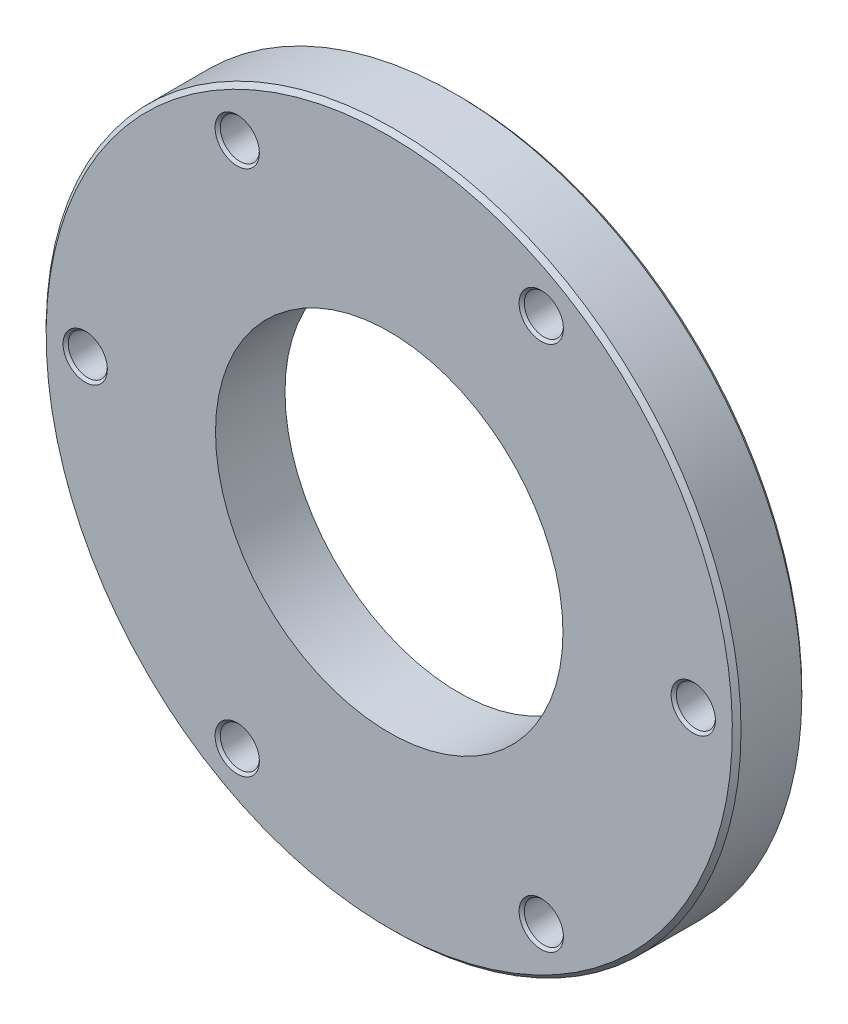
ISO-10303-21;
HEADER;
FILE_DESCRIPTION(('STEP AP214'),'2;1');
FILE_NAME('part.step','',(''),(''),'','','');
FILE_SCHEMA(('AUTOMOTIVE_DESIGN { 1 0 10303 214 1 1 1 1 }'));
ENDSEC;
DATA;
#1=APPLICATION_CONTEXT('core data for automotive mechanical design processes');
#2=APPLICATION_PROTOCOL_DEFINITION('international standard','automotive_design',2000,#1);
#3=PRODUCT_CONTEXT('',#1,'mechanical');
#4=PRODUCT('Part','Part','',(#3));
#5=PRODUCT_RELATED_PRODUCT_CATEGORY('part','',(#4));
#6=PRODUCT_DEFINITION_FORMATION('','',#4);
#7=PRODUCT_DEFINITION_CONTEXT('part definition',#1,'design');
#8=PRODUCT_DEFINITION('design','',#6,#7);
#9=PRODUCT_DEFINITION_SHAPE('','',#8);
#10=(LENGTH_UNIT() NAMED_UNIT(*) SI_UNIT(.MILLI.,.METRE.));
#11=(NAMED_UNIT(*) PLANE_ANGLE_UNIT() SI_UNIT($,.RADIAN.));
#12=(NAMED_UNIT(*) SI_UNIT($,.STERADIAN.) SOLID_ANGLE_UNIT());
#13=UNCERTAINTY_MEASURE_WITH_UNIT(LENGTH_MEASURE(1.E-05),#10,'distance_accuracy_value','');
#14=(GEOMETRIC_REPRESENTATION_CONTEXT(3) GLOBAL_UNCERTAINTY_ASSIGNED_CONTEXT((#13)) GLOBAL_UNIT_ASSIGNED_CONTEXT((#10,
#11,#12)) REPRESENTATION_CONTEXT('',''));
#15=CARTESIAN_POINT('',(0.,0.,0.));
#16=DIRECTION('',(0.,0.,1.));
#17=DIRECTION('',(1.,0.,0.));
#18=AXIS2_PLACEMENT_3D('',#15,#16,#17);
#19=CARTESIAN_POINT('',(17.5,-30.3108891324554,-4.0000000000191));
#20=DIRECTION('',(0.,0.,-1.));
#21=DIRECTION('',(-1.,0.,0.));
#22=AXIS2_PLACEMENT_3D('',#19,#20,#21);
#23=CONICAL_SURFACE('',#22,2.55000000003372,0.785398163368352);
#24=CARTESIAN_POINT('',(17.5,-30.3108891324554,-4.0000000000191));
#25=DIRECTION('',(0.,0.,-1.));
#26=DIRECTION('',(-1.,0.,0.));
#27=AXIS2_PLACEMENT_3D('',#24,#25,#26);
#28=CIRCLE('',#27,2.55000000003372);
#29=CARTESIAN_POINT('',(14.9499999999663,-30.3108891324554,-4.0000000000191));
#30=VERTEX_POINT('',#29);
#31=EDGE_CURVE('E16',#30,#30,#28,.F.);
#32=ORIENTED_EDGE('',*,*,#31,.F.);
#33=EDGE_LOOP('',(#32));
#34=FACE_BOUND('',#33,.T.);
#35=CARTESIAN_POINT('',(17.5,-30.3108891324554,-3.7));
#36=DIRECTION('',(0.,0.,1.));
#37=DIRECTION('',(1.,0.,0.));
#38=AXIS2_PLACEMENT_3D('',#35,#36,#37);
#39=CIRCLE('',#38,2.25);
#40=CARTESIAN_POINT('',(19.75,-30.3108891324554,-3.7));
#41=VERTEX_POINT('',#40);
#42=EDGE_CURVE('E28',#41,#41,#39,.T.);
#43=ORIENTED_EDGE('',*,*,#42,.T.);
#44=EDGE_LOOP('',(#43));
#45=FACE_BOUND('',#44,.T.);
#46=ADVANCED_FACE('F13',(#34,#45),#23,.F.);
#47=CARTESIAN_POINT('',(-17.5,-30.3108891324553,-3.99999999984857));
#48=DIRECTION('',(0.,0.,-1.));
#49=DIRECTION('',(-1.,0.,0.));
#50=AXIS2_PLACEMENT_3D('',#47,#48,#49);
#51=CONICAL_SURFACE('',#50,2.54999999994195,0.785398163450398);
#52=CARTESIAN_POINT('',(-17.5,-30.3108891324553,-3.99999999992622));
#53=DIRECTION('',(0.,0.,-1.));
#54=DIRECTION('',(-1.,0.,0.));
#55=AXIS2_PLACEMENT_3D('',#52,#53,#54);
#56=CIRCLE('',#55,2.5500000000196);
#57=CARTESIAN_POINT('',(-20.0500000000196,-30.3108891324553,-3.99999999992622));
#58=VERTEX_POINT('',#57);
#59=EDGE_CURVE('E67',#58,#58,#56,.F.);
#60=ORIENTED_EDGE('',*,*,#59,.F.);
#61=EDGE_LOOP('',(#60));
#62=FACE_BOUND('',#61,.T.);
#63=CARTESIAN_POINT('',(-17.5,-30.3108891324553,-3.7));
#64=DIRECTION('',(0.,0.,1.));
#65=DIRECTION('',(1.,0.,0.));
#66=AXIS2_PLACEMENT_3D('',#63,#64,#65);
#67=CIRCLE('',#66,2.25);
#68=CARTESIAN_POINT('',(-15.25,-30.3108891324553,-3.7));
#69=VERTEX_POINT('',#68);
#70=EDGE_CURVE('E93',#69,#69,#67,.T.);
#71=ORIENTED_EDGE('',*,*,#70,.T.);
#72=EDGE_LOOP('',(#71));
#73=FACE_BOUND('',#72,.T.);
#74=ADVANCED_FACE('F190',(#62,#73),#51,.F.);
#75=CARTESIAN_POINT('',(-35.,0.,-3.99999999990541));
#76=DIRECTION('',(0.,0.,-1.));
#77=DIRECTION('',(-1.,0.,0.));
#78=AXIS2_PLACEMENT_3D('',#75,#76,#77);
#79=CONICAL_SURFACE('',#78,2.5499999998965,0.785398163397448);
#80=CARTESIAN_POINT('',(-35.,0.,-3.99999999996226));
#81=DIRECTION('',(0.,0.,-1.));
#82=DIRECTION('',(-1.,0.,0.));
#83=AXIS2_PLACEMENT_3D('',#80,#81,#82);
#84=CIRCLE('',#83,2.54999999995334);
#85=CARTESIAN_POINT('',(-37.5499999999533,0.,-3.99999999996226));
#86=VERTEX_POINT('',#85);
#87=EDGE_CURVE('E65',#86,#86,#84,.F.);
#88=ORIENTED_EDGE('',*,*,#87,.F.);
#89=EDGE_LOOP('',(#88));
#90=FACE_BOUND('',#89,.T.);
#91=CARTESIAN_POINT('',(-35.,0.,-3.7));
#92=DIRECTION('',(0.,0.,1.));
#93=DIRECTION('',(1.,0.,0.));
#94=AXIS2_PLACEMENT_3D('',#91,#92,#93);
#95=CIRCLE('',#94,2.25);
#96=CARTESIAN_POINT('',(-32.75,0.,-3.7));
#97=VERTEX_POINT('',#96);
#98=EDGE_CURVE('E91',#97,#97,#95,.T.);
#99=ORIENTED_EDGE('',*,*,#98,.T.);
#100=EDGE_LOOP('',(#99));
#101=FACE_BOUND('',#100,.T.);
#102=ADVANCED_FACE('F187',(#90,#101),#79,.F.);
#103=CARTESIAN_POINT('',(-17.5,30.3108891324554,-4.0000000000191));
#104=DIRECTION('',(0.,0.,-1.));
#105=DIRECTION('',(-1.,0.,0.));
#106=AXIS2_PLACEMENT_3D('',#103,#104,#105);
#107=CONICAL_SURFACE('',#106,2.55000000003372,0.785398163368352);
#108=CARTESIAN_POINT('',(-17.5,30.3108891324554,-4.0000000000191));
#109=DIRECTION('',(0.,0.,-1.));
#110=DIRECTION('',(-1.,0.,0.));
#111=AXIS2_PLACEMENT_3D('',#108,#109,#110);
#112=CIRCLE('',#111,2.55000000003372);
#113=CARTESIAN_POINT('',(-20.0500000000337,30.3108891324554,-4.0000000000191));
#114=VERTEX_POINT('',#113);
#115=EDGE_CURVE('E62',#114,#114,#112,.F.);
#116=ORIENTED_EDGE('',*,*,#115,.F.);
#117=EDGE_LOOP('',(#116));
#118=FACE_BOUND('',#117,.T.);
#119=CARTESIAN_POINT('',(-17.5,30.3108891324554,-3.7));
#120=DIRECTION('',(0.,0.,1.));
#121=DIRECTION('',(1.,0.,0.));
#122=AXIS2_PLACEMENT_3D('',#119,#120,#121);
#123=CIRCLE('',#122,2.25);
#124=CARTESIAN_POINT('',(-15.25,30.3108891324554,-3.7));
#125=VERTEX_POINT('',#124);
#126=EDGE_CURVE('E88',#125,#125,#123,.T.);
#127=ORIENTED_EDGE('',*,*,#126,.T.);
#128=EDGE_LOOP('',(#127));
#129=FACE_BOUND('',#128,.T.);
#130=ADVANCED_FACE('F189',(#118,#129),#107,.F.);
#131=CARTESIAN_POINT('',(17.5,30.3108891324554,-4.0000000000191));
#132=DIRECTION('',(0.,0.,-1.));
#133=DIRECTION('',(-1.,0.,0.));
#134=AXIS2_PLACEMENT_3D('',#131,#132,#133);
#135=CONICAL_SURFACE('',#134,2.55000000003372,0.785398163368352);
#136=CARTESIAN_POINT('',(17.5,30.3108891324554,-4.0000000000191));
#137=DIRECTION('',(0.,0.,-1.));
#138=DIRECTION('',(-1.,0.,0.));
#139=AXIS2_PLACEMENT_3D('',#136,#137,#138);
#140=CIRCLE('',#139,2.55000000003372);
#141=CARTESIAN_POINT('',(14.9499999999663,30.3108891324554,-4.0000000000191));
#142=VERTEX_POINT('',#141);
#143=EDGE_CURVE('E59',#142,#142,#140,.F.);
#144=ORIENTED_EDGE('',*,*,#143,.F.);
#145=EDGE_LOOP('',(#144));
#146=FACE_BOUND('',#145,.T.);
#147=CARTESIAN_POINT('',(17.5,30.3108891324554,-3.7));
#148=DIRECTION('',(0.,0.,1.));
#149=DIRECTION('',(1.,0.,0.));
#150=AXIS2_PLACEMENT_3D('',#147,#148,#149);
#151=CIRCLE('',#150,2.25);
#152=CARTESIAN_POINT('',(19.75,30.3108891324554,-3.7));
#153=VERTEX_POINT('',#152);
#154=EDGE_CURVE('E81',#153,#153,#151,.T.);
#155=ORIENTED_EDGE('',*,*,#154,.T.);
#156=EDGE_LOOP('',(#155));
#157=FACE_BOUND('',#156,.T.);
#158=ADVANCED_FACE('F197',(#146,#157),#135,.F.);
#159=CARTESIAN_POINT('',(35.,0.,-3.99999999990541));
#160=DIRECTION('',(0.,0.,-1.));
#161=DIRECTION('',(-1.,0.,0.));
#162=AXIS2_PLACEMENT_3D('',#159,#160,#161);
#163=CONICAL_SURFACE('',#162,2.5499999998965,0.785398163397448);
#164=CARTESIAN_POINT('',(35.,0.,-3.99999999996226));
#165=DIRECTION('',(0.,0.,-1.));
#166=DIRECTION('',(-1.,0.,0.));
#167=AXIS2_PLACEMENT_3D('',#164,#165,#166);
#168=CIRCLE('',#167,2.54999999995334);
#169=CARTESIAN_POINT('',(32.4500000000467,0.,-3.99999999996226));
#170=VERTEX_POINT('',#169);
#171=EDGE_CURVE('E56',#170,#170,#168,.F.);
#172=ORIENTED_EDGE('',*,*,#171,.F.);
#173=EDGE_LOOP('',(#172));
#174=FACE_BOUND('',#173,.T.);
#175=CARTESIAN_POINT('',(35.,0.,-3.7));
#176=DIRECTION('',(0.,0.,1.));
#177=DIRECTION('',(1.,0.,0.));
#178=AXIS2_PLACEMENT_3D('',#175,#176,#177);
#179=CIRCLE('',#178,2.25);
#180=CARTESIAN_POINT('',(37.25,0.,-3.7));
#181=VERTEX_POINT('',#180);
#182=EDGE_CURVE('E76',#181,#181,#179,.T.);
#183=ORIENTED_EDGE('',*,*,#182,.T.);
#184=EDGE_LOOP('',(#183));
#185=FACE_BOUND('',#184,.T.);
#186=ADVANCED_FACE('F115',(#174,#185),#163,.F.);
#187=CARTESIAN_POINT('',(0.,0.,-3.50000000000001));
#188=DIRECTION('',(0.,0.,1.));
#189=DIRECTION('',(0.,-1.,0.));
#190=AXIS2_PLACEMENT_3D('',#187,#188,#189);
#191=CONICAL_SURFACE('',#190,40.,0.785398163397445);
#192=CARTESIAN_POINT('',(0.,0.,-4.));
#193=DIRECTION('',(0.,0.,1.));
#194=DIRECTION('',(0.,-1.,0.));
#195=AXIS2_PLACEMENT_3D('',#192,#193,#194);
#196=CIRCLE('',#195,39.5);
#197=CARTESIAN_POINT('',(0.,-39.5,-4.));
#198=VERTEX_POINT('',#197);
#199=EDGE_CURVE('E52',#198,#198,#196,.F.);
#200=ORIENTED_EDGE('',*,*,#199,.F.);
#201=EDGE_LOOP('',(#200));
#202=FACE_BOUND('',#201,.T.);
#203=CARTESIAN_POINT('',(0.,0.,-3.5));
#204=DIRECTION('',(0.,0.,1.));
#205=DIRECTION('',(1.,0.,0.));
#206=AXIS2_PLACEMENT_3D('',#203,#204,#205);
#207=CIRCLE('',#206,40.);
#208=CARTESIAN_POINT('',(40.,0.,-3.5));
#209=VERTEX_POINT('',#208);
#210=EDGE_CURVE('E72',#209,#209,#207,.T.);
#211=ORIENTED_EDGE('',*,*,#210,.F.);
#212=EDGE_LOOP('',(#211));
#213=FACE_BOUND('',#212,.T.);
#214=ADVANCED_FACE('F104',(#202,#213),#191,.T.);
#215=CARTESIAN_POINT('',(17.5,-30.3108891324554,0.));
#216=DIRECTION('',(0.,0.,1.));
#217=DIRECTION('',(1.,0.,0.));
#218=AXIS2_PLACEMENT_3D('',#215,#216,#217);
#219=CYLINDRICAL_SURFACE('',#218,2.25);
#220=CARTESIAN_POINT('',(17.5,-30.3108891324554,3.69999999998072));
#221=DIRECTION('',(0.,0.,1.));
#222=DIRECTION('',(0.499999999990889,-0.866025403789699,0.));
#223=AXIS2_PLACEMENT_3D('',#220,#221,#222);
#224=CIRCLE('',#223,2.2500000000128);
#225=CARTESIAN_POINT('',(18.6249999999859,-32.2594462909933,3.69999999998072));
#226=VERTEX_POINT('',#225);
#227=EDGE_CURVE('E55',#226,#226,#224,.T.);
#228=ORIENTED_EDGE('',*,*,#227,.T.);
#229=EDGE_LOOP('',(#228));
#230=FACE_BOUND('',#229,.T.);
#231=ORIENTED_EDGE('',*,*,#42,.F.);
#232=EDGE_LOOP('',(#231));
#233=FACE_BOUND('',#232,.T.);
#234=ADVANCED_FACE('F101',(#230,#233),#219,.F.);
#235=CARTESIAN_POINT('',(-17.5,-30.3108891324553,0.));
#236=DIRECTION('',(0.,0.,1.));
#237=DIRECTION('',(1.,0.,0.));
#238=AXIS2_PLACEMENT_3D('',#235,#236,#237);
#239=CYLINDRICAL_SURFACE('',#238,2.25);
#240=CARTESIAN_POINT('',(-17.5,-30.3108891324553,3.69999999998072));
#241=DIRECTION('',(0.,0.,1.));
#242=DIRECTION('',(-0.49999999997993,-0.866025403796026,0.));
#243=AXIS2_PLACEMENT_3D('',#240,#241,#242);
#244=CIRCLE('',#243,2.25000000006212);
#245=CARTESIAN_POINT('',(-18.6249999999859,-32.2594462910502,3.69999999998072));
#246=VERTEX_POINT('',#245);
#247=EDGE_CURVE('E447',#246,#246,#244,.T.);
#248=ORIENTED_EDGE('',*,*,#247,.T.);
#249=EDGE_LOOP('',(#248));
#250=FACE_BOUND('',#249,.T.);
#251=ORIENTED_EDGE('',*,*,#70,.F.);
#252=EDGE_LOOP('',(#251));
#253=FACE_BOUND('',#252,.T.);
#254=ADVANCED_FACE('F103',(#250,#253),#239,.F.);
#255=CARTESIAN_POINT('',(-35.,0.,0.));
#256=DIRECTION('',(0.,0.,1.));
#257=DIRECTION('',(1.,0.,0.));
#258=AXIS2_PLACEMENT_3D('',#255,#256,#257);
#259=CYLINDRICAL_SURFACE('',#258,2.25);
#260=CARTESIAN_POINT('',(-35.,0.,3.69999999998072));
#261=DIRECTION('',(0.,0.,1.));
#262=DIRECTION('',(-1.,0.,0.));
#263=AXIS2_PLACEMENT_3D('',#260,#261,#262);
#264=CIRCLE('',#263,2.25000000002865);
#265=CARTESIAN_POINT('',(-37.2500000000286,0.,3.69999999998072));
#266=VERTEX_POINT('',#265);
#267=EDGE_CURVE('E184',#266,#266,#264,.T.);
#268=ORIENTED_EDGE('',*,*,#267,.T.);
#269=EDGE_LOOP('',(#268));
#270=FACE_BOUND('',#269,.T.);
#271=ORIENTED_EDGE('',*,*,#98,.F.);
#272=EDGE_LOOP('',(#271));
#273=FACE_BOUND('',#272,.T.);
#274=ADVANCED_FACE('F112',(#270,#273),#259,.F.);
#275=CARTESIAN_POINT('',(-17.5,30.3108891324554,0.));
#276=DIRECTION('',(0.,0.,1.));
#277=DIRECTION('',(1.,0.,0.));
#278=AXIS2_PLACEMENT_3D('',#275,#276,#277);
#279=CYLINDRICAL_SURFACE('',#278,2.25);
#280=CARTESIAN_POINT('',(-17.5,30.3108891324554,3.69999999998072));
#281=DIRECTION('',(0.,0.,1.));
#282=DIRECTION('',(-0.499999999990889,0.866025403789699,0.));
#283=AXIS2_PLACEMENT_3D('',#280,#281,#282);
#284=CIRCLE('',#283,2.2500000000128);
#285=CARTESIAN_POINT('',(-18.6249999999859,32.2594462909933,3.69999999998072));
#286=VERTEX_POINT('',#285);
#287=EDGE_CURVE('E446',#286,#286,#284,.T.);
#288=ORIENTED_EDGE('',*,*,#287,.T.);
#289=EDGE_LOOP('',(#288));
#290=FACE_BOUND('',#289,.T.);
#291=ORIENTED_EDGE('',*,*,#126,.F.);
#292=EDGE_LOOP('',(#291));
#293=FACE_BOUND('',#292,.T.);
#294=ADVANCED_FACE('F172',(#290,#293),#279,.F.);
#295=CARTESIAN_POINT('',(17.5,30.3108891324554,0.));
#296=DIRECTION('',(0.,0.,1.));
#297=DIRECTION('',(1.,0.,0.));
#298=AXIS2_PLACEMENT_3D('',#295,#296,#297);
#299=CYLINDRICAL_SURFACE('',#298,2.25);
#300=CARTESIAN_POINT('',(17.5,30.3108891324554,3.69999999998072));
#301=DIRECTION('',(0.,0.,1.));
#302=DIRECTION('',(0.499999999990889,0.866025403789699,0.));
#303=AXIS2_PLACEMENT_3D('',#300,#301,#302);
#304=CIRCLE('',#303,2.2500000000128);
#305=CARTESIAN_POINT('',(18.6249999999859,32.2594462909933,3.69999999998072));
#306=VERTEX_POINT('',#305);
#307=EDGE_CURVE('E450',#306,#306,#304,.T.);
#308=ORIENTED_EDGE('',*,*,#307,.T.);
#309=EDGE_LOOP('',(#308));
#310=FACE_BOUND('',#309,.T.);
#311=ORIENTED_EDGE('',*,*,#154,.F.);
#312=EDGE_LOOP('',(#311));
#313=FACE_BOUND('',#312,.T.);
#314=ADVANCED_FACE('F168',(#310,#313),#299,.F.);
#315=CARTESIAN_POINT('',(35.,0.,0.));
#316=DIRECTION('',(0.,0.,1.));
#317=DIRECTION('',(1.,0.,0.));
#318=AXIS2_PLACEMENT_3D('',#315,#316,#317);
#319=CYLINDRICAL_SURFACE('',#318,2.25);
#320=CARTESIAN_POINT('',(35.,0.,3.69999999998072));
#321=DIRECTION('',(0.,0.,1.));
#322=DIRECTION('',(1.,0.,0.));
#323=AXIS2_PLACEMENT_3D('',#320,#321,#322);
#324=CIRCLE('',#323,2.25000000002865);
#325=CARTESIAN_POINT('',(37.2500000000286,0.,3.69999999998072));
#326=VERTEX_POINT('',#325);
#327=EDGE_CURVE('E456',#326,#326,#324,.T.);
#328=ORIENTED_EDGE('',*,*,#327,.T.);
#329=EDGE_LOOP('',(#328));
#330=FACE_BOUND('',#329,.T.);
#331=ORIENTED_EDGE('',*,*,#182,.F.);
#332=EDGE_LOOP('',(#331));
#333=FACE_BOUND('',#332,.T.);
#334=ADVANCED_FACE('F165',(#330,#333),#319,.F.);
#335=CARTESIAN_POINT('',(0.,0.,0.));
#336=DIRECTION('',(0.,0.,1.));
#337=DIRECTION('',(1.,0.,0.));
#338=AXIS2_PLACEMENT_3D('',#335,#336,#337);
#339=CYLINDRICAL_SURFACE('',#338,40.);
#340=ORIENTED_EDGE('',*,*,#210,.T.);
#341=EDGE_LOOP('',(#340));
#342=FACE_BOUND('',#341,.T.);
#343=CARTESIAN_POINT('',(0.,0.,3.5));
#344=DIRECTION('',(0.,0.,-1.));
#345=DIRECTION('',(1.,0.,0.));
#346=AXIS2_PLACEMENT_3D('',#343,#344,#345);
#347=CIRCLE('',#346,40.);
#348=CARTESIAN_POINT('',(40.,0.,3.5));
#349=VERTEX_POINT('',#348);
#350=EDGE_CURVE('E51',#349,#349,#347,.F.);
#351=ORIENTED_EDGE('',*,*,#350,.F.);
#352=EDGE_LOOP('',(#351));
#353=FACE_BOUND('',#352,.T.);
#354=ADVANCED_FACE('F161',(#342,#353),#339,.T.);
#355=CARTESIAN_POINT('',(29.75,0.,-4.));
#356=DIRECTION('',(0.,0.,-1.));
#357=DIRECTION('',(-1.,0.,0.));
#358=AXIS2_PLACEMENT_3D('',#355,#356,#357);
#359=PLANE('',#358);
#360=ORIENTED_EDGE('',*,*,#199,.T.);
#361=EDGE_LOOP('',(#360));
#362=FACE_BOUND('',#361,.T.);
#363=CARTESIAN_POINT('',(0.,0.,-4.));
#364=DIRECTION('',(0.,0.,1.));
#365=DIRECTION('',(1.,0.,0.));
#366=AXIS2_PLACEMENT_3D('',#363,#364,#365);
#367=CIRCLE('',#366,20.);
#368=CARTESIAN_POINT('',(20.,0.,-4.));
#369=VERTEX_POINT('',#368);
#370=EDGE_CURVE('E48',#369,#369,#367,.T.);
#371=ORIENTED_EDGE('',*,*,#370,.T.);
#372=EDGE_LOOP('',(#371));
#373=FACE_BOUND('',#372,.T.);
#374=ORIENTED_EDGE('',*,*,#171,.T.);
#375=EDGE_LOOP('',(#374));
#376=FACE_BOUND('',#375,.T.);
#377=ORIENTED_EDGE('',*,*,#143,.T.);
#378=EDGE_LOOP('',(#377));
#379=FACE_BOUND('',#378,.T.);
#380=ORIENTED_EDGE('',*,*,#115,.T.);
#381=EDGE_LOOP('',(#380));
#382=FACE_BOUND('',#381,.T.);
#383=ORIENTED_EDGE('',*,*,#87,.T.);
#384=EDGE_LOOP('',(#383));
#385=FACE_BOUND('',#384,.T.);
#386=ORIENTED_EDGE('',*,*,#59,.T.);
#387=EDGE_LOOP('',(#386));
#388=FACE_BOUND('',#387,.T.);
#389=ORIENTED_EDGE('',*,*,#31,.T.);
#390=EDGE_LOOP('',(#389));
#391=FACE_BOUND('',#390,.T.);
#392=ADVANCED_FACE('F157',(#362,#373,#376,#379,#382,#385,#388,#391),#359,.T.);
#393=CARTESIAN_POINT('',(17.5,-30.3108891324554,4.0000000000191));
#394=DIRECTION('',(0.,0.,1.));
#395=DIRECTION('',(1.,0.,0.));
#396=AXIS2_PLACEMENT_3D('',#393,#394,#395);
#397=CONICAL_SURFACE('',#396,2.55000000003372,0.785398163368352);
#398=CARTESIAN_POINT('',(17.5,-30.3108891324554,4.0000000000191));
#399=DIRECTION('',(0.,0.,1.));
#400=DIRECTION('',(1.,0.,0.));
#401=AXIS2_PLACEMENT_3D('',#398,#399,#400);
#402=CIRCLE('',#401,2.55000000003372);
#403=CARTESIAN_POINT('',(20.0500000000337,-30.3108891324554,4.0000000000191));
#404=VERTEX_POINT('',#403);
#405=EDGE_CURVE('E45',#404,#404,#402,.F.);
#406=ORIENTED_EDGE('',*,*,#405,.F.);
#407=EDGE_LOOP('',(#406));
#408=FACE_BOUND('',#407,.T.);
#409=ORIENTED_EDGE('',*,*,#227,.F.);
#410=EDGE_LOOP('',(#409));
#411=FACE_BOUND('',#410,.T.);
#412=ADVANCED_FACE('F153',(#408,#411),#397,.F.);
#413=CARTESIAN_POINT('',(-17.5,-30.3108891324553,3.99999999984857));
#414=DIRECTION('',(0.,0.,1.));
#415=DIRECTION('',(1.,0.,0.));
#416=AXIS2_PLACEMENT_3D('',#413,#414,#415);
#417=CONICAL_SURFACE('',#416,2.54999999994195,0.785398163450398);
#418=CARTESIAN_POINT('',(-17.5,-30.3108891324553,3.99999999991114));
#419=DIRECTION('',(0.,0.,1.));
#420=DIRECTION('',(1.,0.,0.));
#421=AXIS2_PLACEMENT_3D('',#418,#419,#420);
#422=CIRCLE('',#421,2.55000000000453);
#423=CARTESIAN_POINT('',(-14.9499999999955,-30.3108891324553,3.99999999991114));
#424=VERTEX_POINT('',#423);
#425=EDGE_CURVE('E42',#424,#424,#422,.F.);
#426=ORIENTED_EDGE('',*,*,#425,.F.);
#427=EDGE_LOOP('',(#426));
#428=FACE_BOUND('',#427,.T.);
#429=ORIENTED_EDGE('',*,*,#247,.F.);
#430=EDGE_LOOP('',(#429));
#431=FACE_BOUND('',#430,.T.);
#432=ADVANCED_FACE('F149',(#428,#431),#417,.F.);
#433=CARTESIAN_POINT('',(-35.,0.,3.99999999990541));
#434=DIRECTION('',(0.,0.,1.));
#435=DIRECTION('',(1.,0.,0.));
#436=AXIS2_PLACEMENT_3D('',#433,#434,#435);
#437=CONICAL_SURFACE('',#436,2.5499999998965,0.785398163397448);
#438=CARTESIAN_POINT('',(-35.,0.,3.99999999996226));
#439=DIRECTION('',(0.,0.,1.));
#440=DIRECTION('',(1.,0.,0.));
#441=AXIS2_PLACEMENT_3D('',#438,#439,#440);
#442=CIRCLE('',#441,2.54999999995334);
#443=CARTESIAN_POINT('',(-32.4500000000467,0.,3.99999999996226));
#444=VERTEX_POINT('',#443);
#445=EDGE_CURVE('E39',#444,#444,#442,.F.);
#446=ORIENTED_EDGE('',*,*,#445,.F.);
#447=EDGE_LOOP('',(#446));
#448=FACE_BOUND('',#447,.T.);
#449=ORIENTED_EDGE('',*,*,#267,.F.);
#450=EDGE_LOOP('',(#449));
#451=FACE_BOUND('',#450,.T.);
#452=ADVANCED_FACE('F145',(#448,#451),#437,.F.);
#453=CARTESIAN_POINT('',(-17.5,30.3108891324554,4.0000000000191));
#454=DIRECTION('',(0.,0.,1.));
#455=DIRECTION('',(1.,0.,0.));
#456=AXIS2_PLACEMENT_3D('',#453,#454,#455);
#457=CONICAL_SURFACE('',#456,2.55000000003372,0.785398163368352);
#458=CARTESIAN_POINT('',(-17.5,30.3108891324554,4.0000000000191));
#459=DIRECTION('',(0.,0.,1.));
#460=DIRECTION('',(1.,0.,0.));
#461=AXIS2_PLACEMENT_3D('',#458,#459,#460);
#462=CIRCLE('',#461,2.55000000003372);
#463=CARTESIAN_POINT('',(-14.9499999999663,30.3108891324554,4.0000000000191));
#464=VERTEX_POINT('',#463);
#465=EDGE_CURVE('E36',#464,#464,#462,.F.);
#466=ORIENTED_EDGE('',*,*,#465,.F.);
#467=EDGE_LOOP('',(#466));
#468=FACE_BOUND('',#467,.T.);
#469=ORIENTED_EDGE('',*,*,#287,.F.);
#470=EDGE_LOOP('',(#469));
#471=FACE_BOUND('',#470,.T.);
#472=ADVANCED_FACE('F141',(#468,#471),#457,.F.);
#473=CARTESIAN_POINT('',(17.5,30.3108891324554,4.0000000000191));
#474=DIRECTION('',(0.,0.,1.));
#475=DIRECTION('',(1.,0.,0.));
#476=AXIS2_PLACEMENT_3D('',#473,#474,#475);
#477=CONICAL_SURFACE('',#476,2.55000000003372,0.785398163368352);
#478=CARTESIAN_POINT('',(17.5,30.3108891324554,4.0000000000191));
#479=DIRECTION('',(0.,0.,1.));
#480=DIRECTION('',(1.,0.,0.));
#481=AXIS2_PLACEMENT_3D('',#478,#479,#480);
#482=CIRCLE('',#481,2.55000000003372);
#483=CARTESIAN_POINT('',(20.0500000000337,30.3108891324554,4.0000000000191));
#484=VERTEX_POINT('',#483);
#485=EDGE_CURVE('E33',#484,#484,#482,.F.);
#486=ORIENTED_EDGE('',*,*,#485,.F.);
#487=EDGE_LOOP('',(#486));
#488=FACE_BOUND('',#487,.T.);
#489=ORIENTED_EDGE('',*,*,#307,.F.);
#490=EDGE_LOOP('',(#489));
#491=FACE_BOUND('',#490,.T.);
#492=ADVANCED_FACE('F137',(#488,#491),#477,.F.);
#493=CARTESIAN_POINT('',(35.,0.,3.99999999990541));
#494=DIRECTION('',(0.,0.,1.));
#495=DIRECTION('',(1.,0.,0.));
#496=AXIS2_PLACEMENT_3D('',#493,#494,#495);
#497=CONICAL_SURFACE('',#496,2.5499999998965,0.785398163397448);
#498=CARTESIAN_POINT('',(35.,0.,3.99999999996226));
#499=DIRECTION('',(0.,0.,1.));
#500=DIRECTION('',(1.,0.,0.));
#501=AXIS2_PLACEMENT_3D('',#498,#499,#500);
#502=CIRCLE('',#501,2.54999999995334);
#503=CARTESIAN_POINT('',(37.5499999999533,0.,3.99999999996226));
#504=VERTEX_POINT('',#503);
#505=EDGE_CURVE('E25',#504,#504,#502,.F.);
#506=ORIENTED_EDGE('',*,*,#505,.F.);
#507=EDGE_LOOP('',(#506));
#508=FACE_BOUND('',#507,.T.);
#509=ORIENTED_EDGE('',*,*,#327,.F.);
#510=EDGE_LOOP('',(#509));
#511=FACE_BOUND('',#510,.T.);
#512=ADVANCED_FACE('F133',(#508,#511),#497,.F.);
#513=CARTESIAN_POINT('',(0.,0.,3.50000000000001));
#514=DIRECTION('',(0.,0.,-1.));
#515=DIRECTION('',(0.,1.,0.));
#516=AXIS2_PLACEMENT_3D('',#513,#514,#515);
#517=CONICAL_SURFACE('',#516,40.,0.785398163397445);
#518=ORIENTED_EDGE('',*,*,#350,.T.);
#519=EDGE_LOOP('',(#518));
#520=FACE_BOUND('',#519,.T.);
#521=CARTESIAN_POINT('',(0.,0.,4.));
#522=DIRECTION('',(0.,0.,-1.));
#523=DIRECTION('',(0.,1.,0.));
#524=AXIS2_PLACEMENT_3D('',#521,#522,#523);
#525=CIRCLE('',#524,39.5);
#526=CARTESIAN_POINT('',(0.,39.5,4.));
#527=VERTEX_POINT('',#526);
#528=EDGE_CURVE('E20',#527,#527,#525,.F.);
#529=ORIENTED_EDGE('',*,*,#528,.F.);
#530=EDGE_LOOP('',(#529));
#531=FACE_BOUND('',#530,.T.);
#532=ADVANCED_FACE('F126',(#520,#531),#517,.T.);
#533=CARTESIAN_POINT('',(0.,0.,0.));
#534=DIRECTION('',(0.,0.,1.));
#535=DIRECTION('',(1.,0.,0.));
#536=AXIS2_PLACEMENT_3D('',#533,#534,#535);
#537=CYLINDRICAL_SURFACE('',#536,20.);
#538=CARTESIAN_POINT('',(0.,0.,4.));
#539=DIRECTION('',(0.,0.,1.));
#540=DIRECTION('',(1.,0.,0.));
#541=AXIS2_PLACEMENT_3D('',#538,#539,#540);
#542=CIRCLE('',#541,20.);
#543=CARTESIAN_POINT('',(20.,0.,4.));
#544=VERTEX_POINT('',#543);
#545=EDGE_CURVE('E9',#544,#544,#542,.F.);
#546=ORIENTED_EDGE('',*,*,#545,.F.);
#547=EDGE_LOOP('',(#546));
#548=FACE_BOUND('',#547,.T.);
#549=ORIENTED_EDGE('',*,*,#370,.F.);
#550=EDGE_LOOP('',(#549));
#551=FACE_BOUND('',#550,.T.);
#552=ADVANCED_FACE('F121',(#548,#551),#537,.F.);
#553=CARTESIAN_POINT('',(29.75,0.,4.));
#554=DIRECTION('',(0.,0.,1.));
#555=DIRECTION('',(1.,0.,0.));
#556=AXIS2_PLACEMENT_3D('',#553,#554,#555);
#557=PLANE('',#556);
#558=ORIENTED_EDGE('',*,*,#545,.T.);
#559=EDGE_LOOP('',(#558));
#560=FACE_BOUND('',#559,.T.);
#561=ORIENTED_EDGE('',*,*,#528,.T.);
#562=EDGE_LOOP('',(#561));
#563=FACE_BOUND('',#562,.T.);
#564=ORIENTED_EDGE('',*,*,#505,.T.);
#565=EDGE_LOOP('',(#564));
#566=FACE_BOUND('',#565,.T.);
#567=ORIENTED_EDGE('',*,*,#485,.T.);
#568=EDGE_LOOP('',(#567));
#569=FACE_BOUND('',#568,.T.);
#570=ORIENTED_EDGE('',*,*,#465,.T.);
#571=EDGE_LOOP('',(#570));
#572=FACE_BOUND('',#571,.T.);
#573=ORIENTED_EDGE('',*,*,#445,.T.);
#574=EDGE_LOOP('',(#573));
#575=FACE_BOUND('',#574,.T.);
#576=ORIENTED_EDGE('',*,*,#425,.T.);
#577=EDGE_LOOP('',(#576));
#578=FACE_BOUND('',#577,.T.);
#579=ORIENTED_EDGE('',*,*,#405,.T.);
#580=EDGE_LOOP('',(#579));
#581=FACE_BOUND('',#580,.T.);
#582=ADVANCED_FACE('F119',(#560,#563,#566,#569,#572,#575,#578,#581),#557,.T.);
#583=CLOSED_SHELL('',(#46,#74,#102,#130,#158,#186,#214,#234,#254,#274,#294,#314,#334,#354,#392,
#412,#432,#452,#472,#492,#512,#532,#552,#582));
#584=MANIFOLD_SOLID_BREP('B1',#583);
#585=ADVANCED_BREP_SHAPE_REPRESENTATION('',(#18,#584),#14);
#586=SHAPE_DEFINITION_REPRESENTATION(#9,#585);
ENDSEC;
END-ISO-10303-21;
